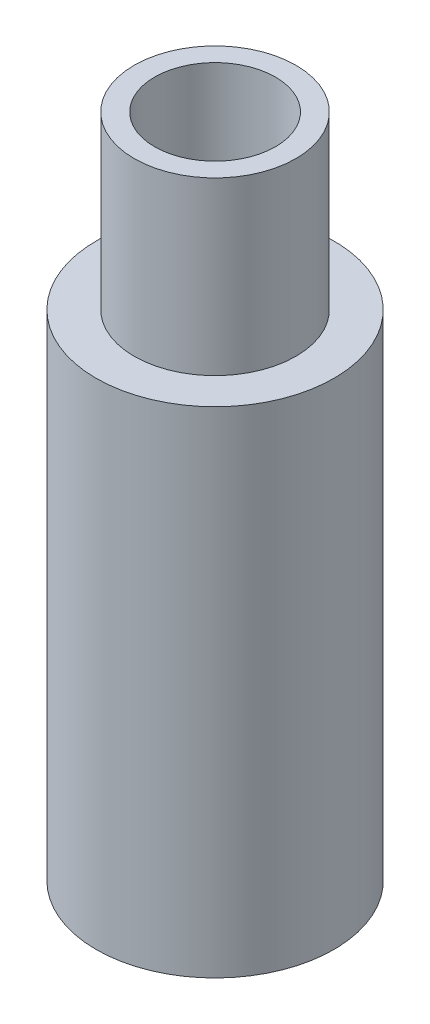
ISO-10303-21;
HEADER;
FILE_DESCRIPTION(('STEP AP214'),'2;1');
FILE_NAME('part.step','',(''),(''),'','','');
FILE_SCHEMA(('AUTOMOTIVE_DESIGN { 1 0 10303 214 1 1 1 1 }'));
ENDSEC;
DATA;
#1=APPLICATION_CONTEXT('core data for automotive mechanical design processes');
#2=APPLICATION_PROTOCOL_DEFINITION('international standard','automotive_design',2000,#1);
#3=PRODUCT_CONTEXT('',#1,'mechanical');
#4=PRODUCT('Part','Part','',(#3));
#5=PRODUCT_RELATED_PRODUCT_CATEGORY('part','',(#4));
#6=PRODUCT_DEFINITION_FORMATION('','',#4);
#7=PRODUCT_DEFINITION_CONTEXT('part definition',#1,'design');
#8=PRODUCT_DEFINITION('design','',#6,#7);
#9=PRODUCT_DEFINITION_SHAPE('','',#8);
#10=(LENGTH_UNIT() NAMED_UNIT(*) SI_UNIT(.MILLI.,.METRE.));
#11=(NAMED_UNIT(*) PLANE_ANGLE_UNIT() SI_UNIT($,.RADIAN.));
#12=(NAMED_UNIT(*) SI_UNIT($,.STERADIAN.) SOLID_ANGLE_UNIT());
#13=UNCERTAINTY_MEASURE_WITH_UNIT(LENGTH_MEASURE(1.E-05),#10,'distance_accuracy_value','');
#14=(GEOMETRIC_REPRESENTATION_CONTEXT(3) GLOBAL_UNCERTAINTY_ASSIGNED_CONTEXT((#13)) GLOBAL_UNIT_ASSIGNED_CONTEXT((#10,
#11,#12)) REPRESENTATION_CONTEXT('',''));
#15=CARTESIAN_POINT('',(0.,0.,0.));
#16=DIRECTION('',(0.,0.,1.));
#17=DIRECTION('',(1.,0.,0.));
#18=AXIS2_PLACEMENT_3D('',#15,#16,#17);
#19=CARTESIAN_POINT('',(0.,35.,0.));
#20=DIRECTION('',(0.,-1.,0.));
#21=DIRECTION('',(0.,0.,-1.));
#22=AXIS2_PLACEMENT_3D('',#19,#20,#21);
#23=CYLINDRICAL_SURFACE('',#22,3.175);
#24=CARTESIAN_POINT('',(0.,35.,0.));
#25=DIRECTION('',(0.,1.,0.));
#26=DIRECTION('',(0.,0.,1.));
#27=AXIS2_PLACEMENT_3D('',#24,#25,#26);
#28=CIRCLE('',#27,3.175);
#29=CARTESIAN_POINT('',(0.,35.,3.175));
#30=VERTEX_POINT('',#29);
#31=EDGE_CURVE('E45',#30,#30,#28,.T.);
#32=ORIENTED_EDGE('',*,*,#31,.T.);
#33=EDGE_LOOP('',(#32));
#34=FACE_BOUND('',#33,.T.);
#35=CARTESIAN_POINT('',(0.,9.,0.));
#36=DIRECTION('',(0.,-1.,0.));
#37=DIRECTION('',(0.,0.,-1.));
#38=AXIS2_PLACEMENT_3D('',#35,#36,#37);
#39=CIRCLE('',#38,3.175);
#40=CARTESIAN_POINT('',(0.,9.,-3.175));
#41=VERTEX_POINT('',#40);
#42=EDGE_CURVE('E41',#41,#41,#39,.T.);
#43=ORIENTED_EDGE('',*,*,#42,.T.);
#44=EDGE_LOOP('',(#43));
#45=FACE_BOUND('',#44,.T.);
#46=ADVANCED_FACE('F37',(#34,#45),#23,.F.);
#47=CARTESIAN_POINT('',(0.,35.,0.));
#48=DIRECTION('',(0.,1.,0.));
#49=DIRECTION('',(0.,0.,1.));
#50=AXIS2_PLACEMENT_3D('',#47,#48,#49);
#51=PLANE('',#50);
#52=ORIENTED_EDGE('',*,*,#31,.F.);
#53=EDGE_LOOP('',(#52));
#54=FACE_BOUND('',#53,.T.);
#55=CARTESIAN_POINT('',(0.,35.,0.));
#56=DIRECTION('',(0.,1.,0.));
#57=DIRECTION('',(0.,0.,1.));
#58=AXIS2_PLACEMENT_3D('',#55,#56,#57);
#59=CIRCLE('',#58,4.25);
#60=CARTESIAN_POINT('',(0.,35.,4.25));
#61=VERTEX_POINT('',#60);
#62=EDGE_CURVE('E58',#61,#61,#59,.T.);
#63=ORIENTED_EDGE('',*,*,#62,.T.);
#64=EDGE_LOOP('',(#63));
#65=FACE_BOUND('',#64,.T.);
#66=ADVANCED_FACE('F86',(#54,#65),#51,.T.);
#67=CARTESIAN_POINT('',(0.,35.,0.));
#68=DIRECTION('',(0.,-1.,0.));
#69=DIRECTION('',(0.,0.,-1.));
#70=AXIS2_PLACEMENT_3D('',#67,#68,#69);
#71=CYLINDRICAL_SURFACE('',#70,6.25);
#72=CARTESIAN_POINT('',(0.,0.,0.));
#73=DIRECTION('',(0.,1.,0.));
#74=DIRECTION('',(0.,0.,1.));
#75=AXIS2_PLACEMENT_3D('',#72,#73,#74);
#76=CIRCLE('',#75,6.25);
#77=CARTESIAN_POINT('',(0.,0.,6.25));
#78=VERTEX_POINT('',#77);
#79=EDGE_CURVE('E11',#78,#78,#76,.T.);
#80=ORIENTED_EDGE('',*,*,#79,.T.);
#81=EDGE_LOOP('',(#80));
#82=FACE_BOUND('',#81,.T.);
#83=CARTESIAN_POINT('',(0.,26.,0.));
#84=DIRECTION('',(0.,1.,0.));
#85=DIRECTION('',(0.,0.,1.));
#86=AXIS2_PLACEMENT_3D('',#83,#84,#85);
#87=CIRCLE('',#86,6.25);
#88=CARTESIAN_POINT('',(0.,26.,6.25));
#89=VERTEX_POINT('',#88);
#90=EDGE_CURVE('E50',#89,#89,#87,.T.);
#91=ORIENTED_EDGE('',*,*,#90,.F.);
#92=EDGE_LOOP('',(#91));
#93=FACE_BOUND('',#92,.T.);
#94=ADVANCED_FACE('F39',(#82,#93),#71,.T.);
#95=CARTESIAN_POINT('',(0.,0.,0.));
#96=DIRECTION('',(0.,1.,0.));
#97=DIRECTION('',(0.,0.,1.));
#98=AXIS2_PLACEMENT_3D('',#95,#96,#97);
#99=PLANE('',#98);
#100=CARTESIAN_POINT('',(0.,0.,0.));
#101=DIRECTION('',(0.,-1.,0.));
#102=DIRECTION('',(0.,0.,-1.));
#103=AXIS2_PLACEMENT_3D('',#100,#101,#102);
#104=CIRCLE('',#103,4.25);
#105=CARTESIAN_POINT('',(0.,0.,-4.25));
#106=VERTEX_POINT('',#105);
#107=EDGE_CURVE('E64',#106,#106,#104,.T.);
#108=ORIENTED_EDGE('',*,*,#107,.F.);
#109=EDGE_LOOP('',(#108));
#110=FACE_BOUND('',#109,.T.);
#111=ORIENTED_EDGE('',*,*,#79,.F.);
#112=EDGE_LOOP('',(#111));
#113=FACE_BOUND('',#112,.T.);
#114=ADVANCED_FACE('F97',(#110,#113),#99,.F.);
#115=CARTESIAN_POINT('',(0.,26.,0.));
#116=DIRECTION('',(0.,1.,0.));
#117=DIRECTION('',(0.,0.,1.));
#118=AXIS2_PLACEMENT_3D('',#115,#116,#117);
#119=PLANE('',#118);
#120=CARTESIAN_POINT('',(0.,26.,0.));
#121=DIRECTION('',(0.,1.,0.));
#122=DIRECTION('',(0.,0.,1.));
#123=AXIS2_PLACEMENT_3D('',#120,#121,#122);
#124=CIRCLE('',#123,4.25);
#125=CARTESIAN_POINT('',(0.,26.,4.25));
#126=VERTEX_POINT('',#125);
#127=EDGE_CURVE('E54',#126,#126,#124,.T.);
#128=ORIENTED_EDGE('',*,*,#127,.F.);
#129=EDGE_LOOP('',(#128));
#130=FACE_BOUND('',#129,.T.);
#131=ORIENTED_EDGE('',*,*,#90,.T.);
#132=EDGE_LOOP('',(#131));
#133=FACE_BOUND('',#132,.T.);
#134=ADVANCED_FACE('F95',(#130,#133),#119,.T.);
#135=CARTESIAN_POINT('',(0.,26.,0.));
#136=DIRECTION('',(0.,1.,0.));
#137=DIRECTION('',(0.,0.,1.));
#138=AXIS2_PLACEMENT_3D('',#135,#136,#137);
#139=CYLINDRICAL_SURFACE('',#138,4.25);
#140=ORIENTED_EDGE('',*,*,#127,.T.);
#141=EDGE_LOOP('',(#140));
#142=FACE_BOUND('',#141,.T.);
#143=ORIENTED_EDGE('',*,*,#62,.F.);
#144=EDGE_LOOP('',(#143));
#145=FACE_BOUND('',#144,.T.);
#146=ADVANCED_FACE('F82',(#142,#145),#139,.T.);
#147=CARTESIAN_POINT('',(0.,9.,0.));
#148=DIRECTION('',(0.,-1.,0.));
#149=DIRECTION('',(0.,0.,-1.));
#150=AXIS2_PLACEMENT_3D('',#147,#148,#149);
#151=CYLINDRICAL_SURFACE('',#150,4.25);
#152=CARTESIAN_POINT('',(0.,9.,0.));
#153=DIRECTION('',(0.,-1.,0.));
#154=DIRECTION('',(0.,0.,-1.));
#155=AXIS2_PLACEMENT_3D('',#152,#153,#154);
#156=CIRCLE('',#155,4.25);
#157=CARTESIAN_POINT('',(0.,9.,-4.25));
#158=VERTEX_POINT('',#157);
#159=EDGE_CURVE('E67',#158,#158,#156,.T.);
#160=ORIENTED_EDGE('',*,*,#159,.F.);
#161=EDGE_LOOP('',(#160));
#162=FACE_BOUND('',#161,.T.);
#163=ORIENTED_EDGE('',*,*,#107,.T.);
#164=EDGE_LOOP('',(#163));
#165=FACE_BOUND('',#164,.T.);
#166=ADVANCED_FACE('F77',(#162,#165),#151,.F.);
#167=CARTESIAN_POINT('',(0.,9.,0.));
#168=DIRECTION('',(0.,-1.,0.));
#169=DIRECTION('',(0.,0.,-1.));
#170=AXIS2_PLACEMENT_3D('',#167,#168,#169);
#171=PLANE('',#170);
#172=ORIENTED_EDGE('',*,*,#42,.F.);
#173=EDGE_LOOP('',(#172));
#174=FACE_BOUND('',#173,.T.);
#175=ORIENTED_EDGE('',*,*,#159,.T.);
#176=EDGE_LOOP('',(#175));
#177=FACE_BOUND('',#176,.T.);
#178=ADVANCED_FACE('F75',(#174,#177),#171,.T.);
#179=CLOSED_SHELL('',(#46,#66,#94,#114,#134,#146,#166,#178));
#180=MANIFOLD_SOLID_BREP('B2',#179);
#181=ADVANCED_BREP_SHAPE_REPRESENTATION('',(#18,#180),#14);
#182=SHAPE_DEFINITION_REPRESENTATION(#9,#181);
ENDSEC;
END-ISO-10303-21;
